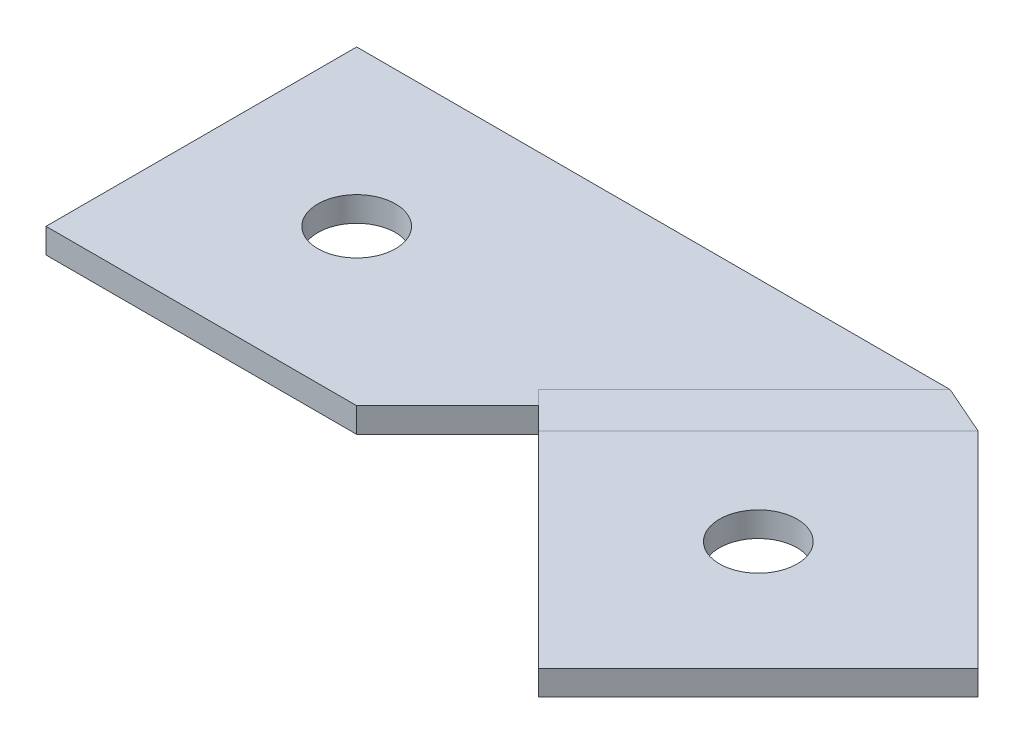
ISO-10303-21;
HEADER;
FILE_DESCRIPTION(('STEP AP214'),'2;1');
FILE_NAME('part.step','',(''),(''),'','','');
FILE_SCHEMA(('AUTOMOTIVE_DESIGN { 1 0 10303 214 1 1 1 1 }'));
ENDSEC;
DATA;
#1=APPLICATION_CONTEXT('core data for automotive mechanical design processes');
#2=APPLICATION_PROTOCOL_DEFINITION('international standard','automotive_design',2000,#1);
#3=PRODUCT_CONTEXT('',#1,'mechanical');
#4=PRODUCT('Part','Part','',(#3));
#5=PRODUCT_RELATED_PRODUCT_CATEGORY('part','',(#4));
#6=PRODUCT_DEFINITION_FORMATION('','',#4);
#7=PRODUCT_DEFINITION_CONTEXT('part definition',#1,'design');
#8=PRODUCT_DEFINITION('design','',#6,#7);
#9=PRODUCT_DEFINITION_SHAPE('','',#8);
#10=(LENGTH_UNIT() NAMED_UNIT(*) SI_UNIT(.MILLI.,.METRE.));
#11=(NAMED_UNIT(*) PLANE_ANGLE_UNIT() SI_UNIT($,.RADIAN.));
#12=(NAMED_UNIT(*) SI_UNIT($,.STERADIAN.) SOLID_ANGLE_UNIT());
#13=UNCERTAINTY_MEASURE_WITH_UNIT(LENGTH_MEASURE(1.E-05),#10,'distance_accuracy_value','');
#14=(GEOMETRIC_REPRESENTATION_CONTEXT(3) GLOBAL_UNCERTAINTY_ASSIGNED_CONTEXT((#13)) GLOBAL_UNIT_ASSIGNED_CONTEXT((#10,
#11,#12)) REPRESENTATION_CONTEXT('',''));
#15=CARTESIAN_POINT('',(0.,0.,0.));
#16=DIRECTION('',(0.,0.,1.));
#17=DIRECTION('',(1.,0.,0.));
#18=AXIS2_PLACEMENT_3D('',#15,#16,#17);
#19=CARTESIAN_POINT('',(39.6452763200141,-1.60000000000013,4.64527632001408));
#20=DIRECTION('',(-0.707106781186547,0.,0.707106781186548));
#21=DIRECTION('',(0.,-1.,0.));
#22=AXIS2_PLACEMENT_3D('',#19,#20,#21);
#23=PLANE('',#22);
#24=CARTESIAN_POINT('',(26.4011663083901,0.,-8.59883369160997));
#25=DIRECTION('',(0.,-1.,0.));
#26=VECTOR('',#25,1.);
#27=LINE('',#24,#26);
#28=CARTESIAN_POINT('',(26.4011663083901,0.,-8.59883369160995));
#29=VERTEX_POINT('',#28);
#30=CARTESIAN_POINT('',(26.4011663083901,-1.6,-8.59883369160996));
#31=VERTEX_POINT('',#30);
#32=EDGE_CURVE('E12',#29,#31,#27,.T.);
#33=ORIENTED_EDGE('',*,*,#32,.F.);
#34=DIRECTION('',(0.707106781186548,0.,0.707106781186547));
#35=VECTOR('',#34,1.);
#36=CARTESIAN_POINT('',(39.6452763200141,-1.2490009027033E-13,4.64527632001409));
#37=LINE('',#36,#35);
#38=CARTESIAN_POINT('',(39.6452763200141,-1.2490009027033E-13,4.64527632001409));
#39=VERTEX_POINT('',#38);
#40=EDGE_CURVE('E59',#29,#39,#37,.T.);
#41=ORIENTED_EDGE('',*,*,#40,.T.);
#42=DIRECTION('',(0.,1.,0.));
#43=VECTOR('',#42,1.);
#44=CARTESIAN_POINT('',(39.6452763200141,-1.60000000000013,4.64527632001408));
#45=LINE('',#44,#43);
#46=CARTESIAN_POINT('',(39.6452763200141,-1.60000000000013,4.64527632001408));
#47=VERTEX_POINT('',#46);
#48=EDGE_CURVE('E150',#47,#39,#45,.T.);
#49=ORIENTED_EDGE('',*,*,#48,.F.);
#50=DIRECTION('',(0.707106781186548,0.,0.707106781186547));
#51=VECTOR('',#50,1.);
#52=CARTESIAN_POINT('',(39.6452763200141,-1.60000000000013,4.64527632001408));
#53=LINE('',#52,#51);
#54=EDGE_CURVE('E324',#31,#47,#53,.T.);
#55=ORIENTED_EDGE('',*,*,#54,.F.);
#56=EDGE_LOOP('',(#33,#41,#49,#55));
#57=FACE_BOUND('',#56,.T.);
#58=ADVANCED_FACE('F43',(#57),#23,.F.);
#59=CARTESIAN_POINT('',(11.3610050725522,-1.59999999999999,4.64527632001409));
#60=DIRECTION('',(0.707106781186547,0.,-0.707106781186548));
#61=DIRECTION('',(0.,1.,0.));
#62=AXIS2_PLACEMENT_3D('',#59,#60,#61);
#63=PLANE('',#62);
#64=DIRECTION('',(0.,-1.,0.));
#65=VECTOR('',#64,1.);
#66=CARTESIAN_POINT('',(12.2590306846591,0.,5.54330193212101));
#67=LINE('',#66,#65);
#68=CARTESIAN_POINT('',(12.2590306846591,0.,5.54330193212101));
#69=VERTEX_POINT('',#68);
#70=CARTESIAN_POINT('',(12.2590306846591,-1.6,5.54330193212099));
#71=VERTEX_POINT('',#70);
#72=EDGE_CURVE('E121',#69,#71,#67,.T.);
#73=ORIENTED_EDGE('',*,*,#72,.T.);
#74=DIRECTION('',(-0.707106781186548,0.,-0.707106781186547));
#75=VECTOR('',#74,1.);
#76=CARTESIAN_POINT('',(11.3610050725522,-1.59999999999999,4.64527632001409));
#77=LINE('',#76,#75);
#78=CARTESIAN_POINT('',(25.5031406962831,-1.60000000000013,18.787411943745));
#79=VERTEX_POINT('',#78);
#80=EDGE_CURVE('E124',#79,#71,#77,.T.);
#81=ORIENTED_EDGE('',*,*,#80,.F.);
#82=DIRECTION('',(0.,1.,0.));
#83=VECTOR('',#82,1.);
#84=CARTESIAN_POINT('',(25.5031406962831,-1.60000000000013,18.787411943745));
#85=LINE('',#84,#83);
#86=CARTESIAN_POINT('',(25.5031406962832,-1.28369537222284E-13,18.787411943745));
#87=VERTEX_POINT('',#86);
#88=EDGE_CURVE('E138',#79,#87,#85,.T.);
#89=ORIENTED_EDGE('',*,*,#88,.T.);
#90=DIRECTION('',(-0.707106781186548,0.,-0.707106781186547));
#91=VECTOR('',#90,1.);
#92=CARTESIAN_POINT('',(11.3610050725522,0.,4.6452763200141));
#93=LINE('',#92,#91);
#94=EDGE_CURVE('E67',#87,#69,#93,.T.);
#95=ORIENTED_EDGE('',*,*,#94,.T.);
#96=EDGE_LOOP('',(#73,#81,#89,#95));
#97=FACE_BOUND('',#96,.T.);
#98=ADVANCED_FACE('F123',(#97),#63,.F.);
#99=CARTESIAN_POINT('',(8.00314069628311,-1.59999999999999,8.00314069628312));
#100=DIRECTION('',(0.,1.,0.));
#101=DIRECTION('',(-0.707106781186547,0.,0.707106781186548));
#102=AXIS2_PLACEMENT_3D('',#99,#100,#101);
#103=PLANE('',#102);
#104=CARTESIAN_POINT('',(25.5031406962831,-1.60000000000006,4.64527632001404));
#105=DIRECTION('',(0.,1.,0.));
#106=DIRECTION('',(-0.707106781186547,0.,0.707106781186548));
#107=AXIS2_PLACEMENT_3D('',#104,#105,#106);
#108=CIRCLE('',#107,2.5);
#109=CARTESIAN_POINT('',(23.7353737433168,-1.60000000000006,6.41304327298041));
#110=VERTEX_POINT('',#109);
#111=EDGE_CURVE('E333',#110,#110,#108,.T.);
#112=ORIENTED_EDGE('',*,*,#111,.T.);
#113=EDGE_LOOP('',(#112));
#114=FACE_BOUND('',#113,.T.);
#115=DIRECTION('',(-0.707106781186548,0.,0.707106781186548));
#116=VECTOR('',#115,1.);
#117=CARTESIAN_POINT('',(8.90116630839005,-1.6,8.90116630839006));
#118=LINE('',#117,#116);
#119=EDGE_CURVE('E129',#31,#71,#118,.T.);
#120=ORIENTED_EDGE('',*,*,#119,.F.);
#121=ORIENTED_EDGE('',*,*,#54,.T.);
#122=DIRECTION('',(-0.707106781186547,0.,0.707106781186548));
#123=VECTOR('',#122,1.);
#124=CARTESIAN_POINT('',(25.5031406962831,-1.60000000000013,18.787411943745));
#125=LINE('',#124,#123);
#126=EDGE_CURVE('E136',#47,#79,#125,.T.);
#127=ORIENTED_EDGE('',*,*,#126,.T.);
#128=ORIENTED_EDGE('',*,*,#80,.T.);
#129=EDGE_LOOP('',(#120,#121,#127,#128));
#130=FACE_BOUND('',#129,.T.);
#131=ADVANCED_FACE('F133',(#114,#130),#103,.F.);
#132=CARTESIAN_POINT('',(8.00314069628312,0.,8.00314069628313));
#133=DIRECTION('',(0.,1.,0.));
#134=DIRECTION('',(-0.707106781186547,0.,0.707106781186548));
#135=AXIS2_PLACEMENT_3D('',#132,#133,#134);
#136=PLANE('',#135);
#137=CARTESIAN_POINT('',(25.5031406962832,0.,4.64527632001405));
#138=DIRECTION('',(0.,1.,0.));
#139=DIRECTION('',(-0.707106781186547,0.,0.707106781186548));
#140=AXIS2_PLACEMENT_3D('',#137,#138,#139);
#141=CIRCLE('',#140,2.5);
#142=CARTESIAN_POINT('',(23.7353737433168,0.,6.41304327298042));
#143=VERTEX_POINT('',#142);
#144=EDGE_CURVE('E238',#143,#143,#141,.T.);
#145=ORIENTED_EDGE('',*,*,#144,.F.);
#146=EDGE_LOOP('',(#145));
#147=FACE_BOUND('',#146,.T.);
#148=ORIENTED_EDGE('',*,*,#40,.F.);
#149=DIRECTION('',(0.707106781186548,0.,-0.707106781186548));
#150=VECTOR('',#149,1.);
#151=CARTESIAN_POINT('',(12.2590306846591,0.,5.54330193212101));
#152=LINE('',#151,#150);
#153=EDGE_CURVE('E52',#69,#29,#152,.T.);
#154=ORIENTED_EDGE('',*,*,#153,.F.);
#155=ORIENTED_EDGE('',*,*,#94,.F.);
#156=DIRECTION('',(-0.707106781186547,0.,0.707106781186548));
#157=VECTOR('',#156,1.);
#158=CARTESIAN_POINT('',(25.5031406962832,-1.28369537222284E-13,18.787411943745));
#159=LINE('',#158,#157);
#160=EDGE_CURVE('E332',#39,#87,#159,.T.);
#161=ORIENTED_EDGE('',*,*,#160,.F.);
#162=EDGE_LOOP('',(#148,#154,#155,#161));
#163=FACE_BOUND('',#162,.T.);
#164=ADVANCED_FACE('F306',(#147,#163),#136,.T.);
#165=CARTESIAN_POINT('',(25.5031406962831,-1.60000000000013,18.787411943745));
#166=DIRECTION('',(-0.707106781186548,0.,-0.707106781186547));
#167=DIRECTION('',(0.500000000000003,0.707106781186548,-0.499999999999997));
#168=AXIS2_PLACEMENT_3D('',#165,#166,#167);
#169=PLANE('',#168);
#170=ORIENTED_EDGE('',*,*,#160,.T.);
#171=ORIENTED_EDGE('',*,*,#88,.F.);
#172=ORIENTED_EDGE('',*,*,#126,.F.);
#173=ORIENTED_EDGE('',*,*,#48,.T.);
#174=EDGE_LOOP('',(#170,#171,#172,#173));
#175=FACE_BOUND('',#174,.T.);
#176=ADVANCED_FACE('F302',(#175),#169,.F.);
#177=CARTESIAN_POINT('',(25.5031406962831,-15.065645361033,4.64527632001397));
#178=DIRECTION('',(0.,1.,0.));
#179=DIRECTION('',(-0.707106781186547,0.,0.707106781186548));
#180=AXIS2_PLACEMENT_3D('',#177,#178,#179);
#181=CYLINDRICAL_SURFACE('',#180,2.5);
#182=ORIENTED_EDGE('',*,*,#144,.T.);
#183=EDGE_LOOP('',(#182));
#184=FACE_BOUND('',#183,.T.);
#185=ORIENTED_EDGE('',*,*,#111,.F.);
#186=EDGE_LOOP('',(#185));
#187=FACE_BOUND('',#186,.T.);
#188=ADVANCED_FACE('F298',(#184,#187),#181,.F.);
#189=CARTESIAN_POINT('',(-15.,-1.6,-10.));
#190=DIRECTION('',(-1.,0.,0.));
#191=DIRECTION('',(0.,0.,1.));
#192=AXIS2_PLACEMENT_3D('',#189,#190,#191);
#193=PLANE('',#192);
#194=DIRECTION('',(0.,0.,1.));
#195=VECTOR('',#194,1.);
#196=CARTESIAN_POINT('',(-15.,0.,-10.));
#197=LINE('',#196,#195);
#198=CARTESIAN_POINT('',(-15.,0.,-10.));
#199=VERTEX_POINT('',#198);
#200=CARTESIAN_POINT('',(-15.,0.,10.));
#201=VERTEX_POINT('',#200);
#202=EDGE_CURVE('E246',#199,#201,#197,.T.);
#203=ORIENTED_EDGE('',*,*,#202,.F.);
#204=DIRECTION('',(0.,1.,0.));
#205=VECTOR('',#204,1.);
#206=CARTESIAN_POINT('',(-15.,-1.6,-10.));
#207=LINE('',#206,#205);
#208=CARTESIAN_POINT('',(-15.,-1.6,-10.));
#209=VERTEX_POINT('',#208);
#210=EDGE_CURVE('E230',#209,#199,#207,.T.);
#211=ORIENTED_EDGE('',*,*,#210,.F.);
#212=DIRECTION('',(0.,0.,1.));
#213=VECTOR('',#212,1.);
#214=CARTESIAN_POINT('',(-15.,-1.6,-10.));
#215=LINE('',#214,#213);
#216=CARTESIAN_POINT('',(-15.,-1.6,10.));
#217=VERTEX_POINT('',#216);
#218=EDGE_CURVE('E158',#209,#217,#215,.T.);
#219=ORIENTED_EDGE('',*,*,#218,.T.);
#220=DIRECTION('',(0.,1.,0.));
#221=VECTOR('',#220,1.);
#222=CARTESIAN_POINT('',(-15.,-1.6,10.));
#223=LINE('',#222,#221);
#224=EDGE_CURVE('E270',#217,#201,#223,.T.);
#225=ORIENTED_EDGE('',*,*,#224,.T.);
#226=EDGE_LOOP('',(#203,#211,#219,#225));
#227=FACE_BOUND('',#226,.T.);
#228=ADVANCED_FACE('F301',(#227),#193,.T.);
#229=CARTESIAN_POINT('',(-15.,-1.6,10.));
#230=DIRECTION('',(0.,0.,1.));
#231=DIRECTION('',(1.,0.,0.));
#232=AXIS2_PLACEMENT_3D('',#229,#230,#231);
#233=PLANE('',#232);
#234=DIRECTION('',(1.,0.,0.));
#235=VECTOR('',#234,1.);
#236=CARTESIAN_POINT('',(-15.,0.,10.));
#237=LINE('',#236,#235);
#238=CARTESIAN_POINT('',(5.,0.,10.));
#239=VERTEX_POINT('',#238);
#240=EDGE_CURVE('E243',#201,#239,#237,.T.);
#241=ORIENTED_EDGE('',*,*,#240,.F.);
#242=ORIENTED_EDGE('',*,*,#224,.F.);
#243=DIRECTION('',(1.,0.,0.));
#244=VECTOR('',#243,1.);
#245=CARTESIAN_POINT('',(-15.,-1.6,10.));
#246=LINE('',#245,#244);
#247=CARTESIAN_POINT('',(5.,-1.6,10.));
#248=VERTEX_POINT('',#247);
#249=EDGE_CURVE('E267',#217,#248,#246,.T.);
#250=ORIENTED_EDGE('',*,*,#249,.T.);
#251=DIRECTION('',(0.,1.,0.));
#252=VECTOR('',#251,1.);
#253=CARTESIAN_POINT('',(5.,-1.6,10.));
#254=LINE('',#253,#252);
#255=EDGE_CURVE('E265',#248,#239,#254,.T.);
#256=ORIENTED_EDGE('',*,*,#255,.T.);
#257=EDGE_LOOP('',(#241,#242,#250,#256));
#258=FACE_BOUND('',#257,.T.);
#259=ADVANCED_FACE('F363',(#258),#233,.T.);
#260=CARTESIAN_POINT('',(5.,-1.6,10.));
#261=DIRECTION('',(0.707106781186548,0.,0.707106781186548));
#262=DIRECTION('',(0.707106781186548,0.,-0.707106781186548));
#263=AXIS2_PLACEMENT_3D('',#260,#261,#262);
#264=PLANE('',#263);
#265=DIRECTION('',(0.707106781186548,0.,-0.707106781186547));
#266=VECTOR('',#265,1.);
#267=CARTESIAN_POINT('',(5.,-1.6,10.));
#268=LINE('',#267,#266);
#269=CARTESIAN_POINT('',(10.8578643762691,-1.6,4.14213562373095));
#270=VERTEX_POINT('',#269);
#271=EDGE_CURVE('E263',#248,#270,#268,.T.);
#272=ORIENTED_EDGE('',*,*,#271,.T.);
#273=DIRECTION('',(0.,-1.,0.));
#274=VECTOR('',#273,1.);
#275=CARTESIAN_POINT('',(10.8578643762691,0.,4.14213562373095));
#276=LINE('',#275,#274);
#277=CARTESIAN_POINT('',(10.8578643762691,0.,4.14213562373095));
#278=VERTEX_POINT('',#277);
#279=EDGE_CURVE('E154',#278,#270,#276,.T.);
#280=ORIENTED_EDGE('',*,*,#279,.F.);
#281=DIRECTION('',(0.707106781186548,0.,-0.707106781186547));
#282=VECTOR('',#281,1.);
#283=CARTESIAN_POINT('',(5.,0.,10.));
#284=LINE('',#283,#282);
#285=EDGE_CURVE('E240',#239,#278,#284,.T.);
#286=ORIENTED_EDGE('',*,*,#285,.F.);
#287=ORIENTED_EDGE('',*,*,#255,.F.);
#288=EDGE_LOOP('',(#272,#280,#286,#287));
#289=FACE_BOUND('',#288,.T.);
#290=ADVANCED_FACE('F368',(#289),#264,.T.);
#291=CARTESIAN_POINT('',(-5.,-1.6,0.));
#292=DIRECTION('',(0.,1.,0.));
#293=DIRECTION('',(0.,0.,1.));
#294=AXIS2_PLACEMENT_3D('',#291,#292,#293);
#295=CYLINDRICAL_SURFACE('',#294,2.5);
#296=CARTESIAN_POINT('',(-5.,-1.6,0.));
#297=DIRECTION('',(0.,1.,0.));
#298=DIRECTION('',(0.,0.,1.));
#299=AXIS2_PLACEMENT_3D('',#296,#297,#298);
#300=CIRCLE('',#299,2.5);
#301=CARTESIAN_POINT('',(-5.,-1.6,2.5));
#302=VERTEX_POINT('',#301);
#303=EDGE_CURVE('E257',#302,#302,#300,.T.);
#304=ORIENTED_EDGE('',*,*,#303,.F.);
#305=EDGE_LOOP('',(#304));
#306=FACE_BOUND('',#305,.T.);
#307=CARTESIAN_POINT('',(-5.,0.,0.));
#308=DIRECTION('',(0.,1.,0.));
#309=DIRECTION('',(0.,0.,1.));
#310=AXIS2_PLACEMENT_3D('',#307,#308,#309);
#311=CIRCLE('',#310,2.5);
#312=CARTESIAN_POINT('',(-5.,0.,2.5));
#313=VERTEX_POINT('',#312);
#314=EDGE_CURVE('E260',#313,#313,#311,.T.);
#315=ORIENTED_EDGE('',*,*,#314,.T.);
#316=EDGE_LOOP('',(#315));
#317=FACE_BOUND('',#316,.T.);
#318=ADVANCED_FACE('F370',(#306,#317),#295,.F.);
#319=CARTESIAN_POINT('',(0.,-1.6,0.));
#320=DIRECTION('',(0.,1.,0.));
#321=DIRECTION('',(0.,0.,1.));
#322=AXIS2_PLACEMENT_3D('',#319,#320,#321);
#323=PLANE('',#322);
#324=ORIENTED_EDGE('',*,*,#303,.T.);
#325=EDGE_LOOP('',(#324));
#326=FACE_BOUND('',#325,.T.);
#327=DIRECTION('',(-0.707106781186548,0.,0.707106781186548));
#328=VECTOR('',#327,1.);
#329=CARTESIAN_POINT('',(24.1019743878931,-1.6,-10.8980256121069));
#330=LINE('',#329,#328);
#331=CARTESIAN_POINT('',(23.2039487757862,-1.6,-10.));
#332=VERTEX_POINT('',#331);
#333=CARTESIAN_POINT('',(9.95983876416214,-1.6,3.24411001162404));
#334=VERTEX_POINT('',#333);
#335=EDGE_CURVE('E256',#332,#334,#330,.T.);
#336=ORIENTED_EDGE('',*,*,#335,.T.);
#337=DIRECTION('',(-0.707106781186548,0.,-0.707106781186548));
#338=VECTOR('',#337,1.);
#339=CARTESIAN_POINT('',(3.35786437626905,-1.6,-3.35786437626905));
#340=LINE('',#339,#338);
#341=EDGE_CURVE('E254',#270,#334,#340,.T.);
#342=ORIENTED_EDGE('',*,*,#341,.F.);
#343=ORIENTED_EDGE('',*,*,#271,.F.);
#344=ORIENTED_EDGE('',*,*,#249,.F.);
#345=ORIENTED_EDGE('',*,*,#218,.F.);
#346=DIRECTION('',(-1.,0.,0.));
#347=VECTOR('',#346,1.);
#348=CARTESIAN_POINT('',(-15.,-1.6,-10.));
#349=LINE('',#348,#347);
#350=EDGE_CURVE('E239',#332,#209,#349,.T.);
#351=ORIENTED_EDGE('',*,*,#350,.F.);
#352=EDGE_LOOP('',(#336,#342,#343,#344,#345,#351));
#353=FACE_BOUND('',#352,.T.);
#354=ADVANCED_FACE('F358',(#326,#353),#323,.F.);
#355=CARTESIAN_POINT('',(0.,0.,0.));
#356=DIRECTION('',(0.,1.,0.));
#357=DIRECTION('',(0.,0.,1.));
#358=AXIS2_PLACEMENT_3D('',#355,#356,#357);
#359=PLANE('',#358);
#360=ORIENTED_EDGE('',*,*,#314,.F.);
#361=EDGE_LOOP('',(#360));
#362=FACE_BOUND('',#361,.T.);
#363=DIRECTION('',(0.707106781186547,0.,0.707106781186547));
#364=VECTOR('',#363,1.);
#365=CARTESIAN_POINT('',(9.95983876416214,0.,3.24411001162404));
#366=LINE('',#365,#364);
#367=CARTESIAN_POINT('',(9.95983876416214,0.,3.24411001162404));
#368=VERTEX_POINT('',#367);
#369=EDGE_CURVE('E251',#368,#278,#366,.T.);
#370=ORIENTED_EDGE('',*,*,#369,.F.);
#371=DIRECTION('',(-0.707106781186548,0.,0.707106781186548));
#372=VECTOR('',#371,1.);
#373=CARTESIAN_POINT('',(24.1019743878931,0.,-10.8980256121069));
#374=LINE('',#373,#372);
#375=CARTESIAN_POINT('',(23.2039487757862,0.,-10.));
#376=VERTEX_POINT('',#375);
#377=EDGE_CURVE('E155',#376,#368,#374,.T.);
#378=ORIENTED_EDGE('',*,*,#377,.F.);
#379=DIRECTION('',(-1.,0.,0.));
#380=VECTOR('',#379,1.);
#381=CARTESIAN_POINT('',(-15.,0.,-10.));
#382=LINE('',#381,#380);
#383=EDGE_CURVE('E249',#376,#199,#382,.T.);
#384=ORIENTED_EDGE('',*,*,#383,.T.);
#385=ORIENTED_EDGE('',*,*,#202,.T.);
#386=ORIENTED_EDGE('',*,*,#240,.T.);
#387=ORIENTED_EDGE('',*,*,#285,.T.);
#388=EDGE_LOOP('',(#370,#378,#384,#385,#386,#387));
#389=FACE_BOUND('',#388,.T.);
#390=ADVANCED_FACE('F296',(#362,#389),#359,.T.);
#391=CARTESIAN_POINT('',(-15.,-1.6,-10.));
#392=DIRECTION('',(0.,0.,-1.));
#393=DIRECTION('',(-1.,0.,0.));
#394=AXIS2_PLACEMENT_3D('',#391,#392,#393);
#395=PLANE('',#394);
#396=ORIENTED_EDGE('',*,*,#383,.F.);
#397=CARTESIAN_POINT('',(23.2039487757862,0.,-10.));
#398=DIRECTION('',(0.,-1.,0.));
#399=VECTOR('',#398,1.);
#400=LINE('',#397,#399);
#401=EDGE_CURVE('E226',#376,#332,#400,.T.);
#402=ORIENTED_EDGE('',*,*,#401,.T.);
#403=ORIENTED_EDGE('',*,*,#350,.T.);
#404=ORIENTED_EDGE('',*,*,#210,.T.);
#405=EDGE_LOOP('',(#396,#402,#403,#404));
#406=FACE_BOUND('',#405,.T.);
#407=ADVANCED_FACE('F286',(#406),#395,.T.);
#408=CARTESIAN_POINT('',(23.2039487757862,-1.6,-10.));
#409=DIRECTION('',(0.401391893734024,0.,-0.91590640768837));
#410=DIRECTION('',(0.91590640768837,0.,0.401391893734024));
#411=AXIS2_PLACEMENT_3D('',#408,#409,#410);
#412=PLANE('',#411);
#413=ORIENTED_EDGE('',*,*,#401,.F.);
#414=CARTESIAN_POINT('',(23.2039487757862,0.,-10.));
#415=DIRECTION('',(0.91590640768837,0.,0.401391893734024));
#416=VECTOR('',#415,1.);
#417=LINE('',#414,#416);
#418=EDGE_CURVE('E163',#376,#29,#417,.T.);
#419=ORIENTED_EDGE('',*,*,#418,.T.);
#420=ORIENTED_EDGE('',*,*,#32,.T.);
#421=CARTESIAN_POINT('',(23.2039487757862,-1.6,-10.));
#422=DIRECTION('',(0.91590640768837,0.,0.401391893734024));
#423=VECTOR('',#422,1.);
#424=LINE('',#421,#423);
#425=EDGE_CURVE('E148',#332,#31,#424,.T.);
#426=ORIENTED_EDGE('',*,*,#425,.F.);
#427=EDGE_LOOP('',(#413,#419,#420,#426));
#428=FACE_BOUND('',#427,.T.);
#429=ADVANCED_FACE('F181',(#428),#412,.T.);
#430=CARTESIAN_POINT('',(9.95983876416214,-1.6,3.24411001162404));
#431=DIRECTION('',(-0.707106781186549,0.,0.707106781186546));
#432=DIRECTION('',(-0.707106781186546,0.,-0.707106781186549));
#433=AXIS2_PLACEMENT_3D('',#430,#431,#432);
#434=PLANE('',#433);
#435=DIRECTION('',(-0.707106781186546,0.,-0.707106781186549));
#436=VECTOR('',#435,1.);
#437=CARTESIAN_POINT('',(9.95983876416214,0.,3.24411001162404));
#438=LINE('',#437,#436);
#439=EDGE_CURVE('E160',#69,#278,#438,.T.);
#440=ORIENTED_EDGE('',*,*,#439,.T.);
#441=ORIENTED_EDGE('',*,*,#279,.T.);
#442=DIRECTION('',(-0.707106781186546,0.,-0.707106781186549));
#443=VECTOR('',#442,1.);
#444=CARTESIAN_POINT('',(9.95983876416214,-1.6,3.24411001162404));
#445=LINE('',#444,#443);
#446=EDGE_CURVE('E145',#71,#270,#445,.T.);
#447=ORIENTED_EDGE('',*,*,#446,.F.);
#448=ORIENTED_EDGE('',*,*,#72,.F.);
#449=EDGE_LOOP('',(#440,#441,#447,#448));
#450=FACE_BOUND('',#449,.T.);
#451=ADVANCED_FACE('F153',(#450),#434,.T.);
#452=CARTESIAN_POINT('',(17.7314897302226,-1.6,-2.2283490339395));
#453=DIRECTION('',(0.,-1.,0.));
#454=DIRECTION('',(0.,0.,-1.));
#455=AXIS2_PLACEMENT_3D('',#452,#453,#454);
#456=PLANE('',#455);
#457=ORIENTED_EDGE('',*,*,#119,.T.);
#458=ORIENTED_EDGE('',*,*,#446,.T.);
#459=ORIENTED_EDGE('',*,*,#341,.T.);
#460=ORIENTED_EDGE('',*,*,#335,.F.);
#461=ORIENTED_EDGE('',*,*,#425,.T.);
#462=EDGE_LOOP('',(#457,#458,#459,#460,#461));
#463=FACE_BOUND('',#462,.T.);
#464=ADVANCED_FACE('F143',(#463),#456,.T.);
#465=CARTESIAN_POINT('',(17.7314897302226,0.,-2.2283490339395));
#466=DIRECTION('',(0.,-1.,0.));
#467=DIRECTION('',(0.,0.,-1.));
#468=AXIS2_PLACEMENT_3D('',#465,#466,#467);
#469=PLANE('',#468);
#470=ORIENTED_EDGE('',*,*,#153,.T.);
#471=ORIENTED_EDGE('',*,*,#418,.F.);
#472=ORIENTED_EDGE('',*,*,#377,.T.);
#473=ORIENTED_EDGE('',*,*,#369,.T.);
#474=ORIENTED_EDGE('',*,*,#439,.F.);
#475=EDGE_LOOP('',(#470,#471,#472,#473,#474));
#476=FACE_BOUND('',#475,.T.);
#477=ADVANCED_FACE('F176',(#476),#469,.F.);
#478=CLOSED_SHELL('',(#58,#98,#131,#164,#176,#188,#228,#259,#290,#318,#354,#390,#407,#429,#451,
#464,#477));
#479=MANIFOLD_SOLID_BREP('B2',#478);
#480=ADVANCED_BREP_SHAPE_REPRESENTATION('',(#18,#479),#14);
#481=SHAPE_DEFINITION_REPRESENTATION(#9,#480);
ENDSEC;
END-ISO-10303-21;
